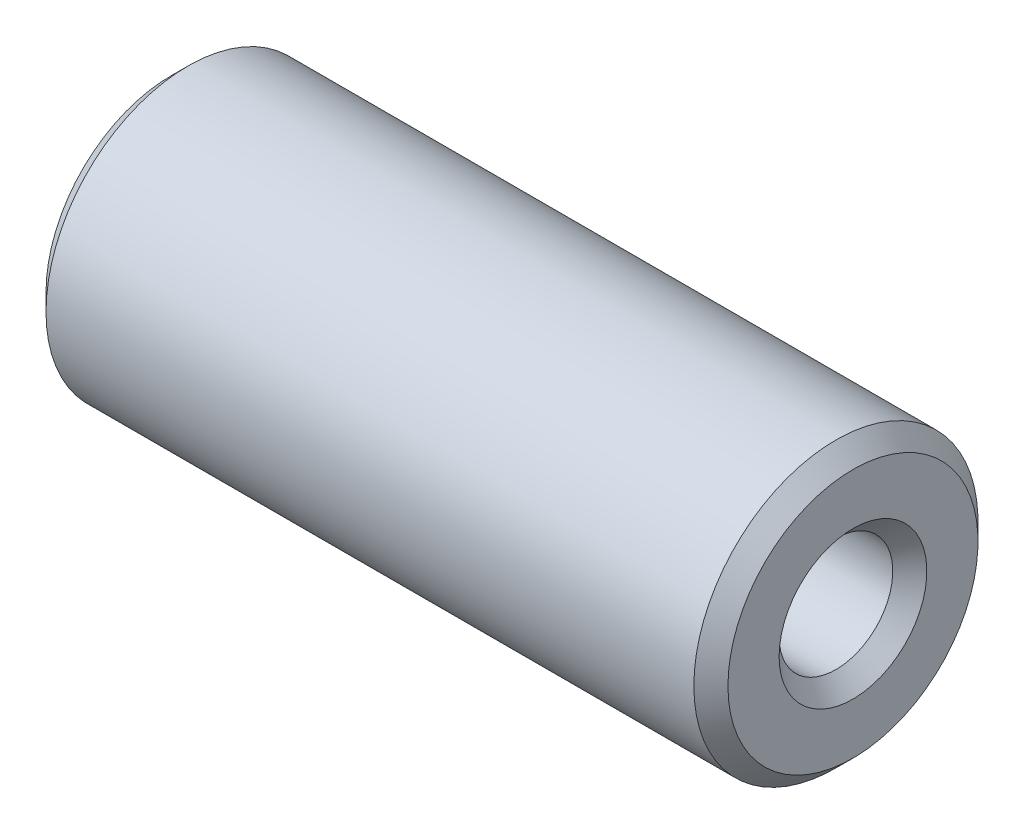
ISO-10303-21;
HEADER;
FILE_DESCRIPTION(('STEP AP214'),'2;1');
FILE_NAME('part.step','',(''),(''),'','','');
FILE_SCHEMA(('AUTOMOTIVE_DESIGN { 1 0 10303 214 1 1 1 1 }'));
ENDSEC;
DATA;
#1=APPLICATION_CONTEXT('core data for automotive mechanical design processes');
#2=APPLICATION_PROTOCOL_DEFINITION('international standard','automotive_design',2000,#1);
#3=PRODUCT_CONTEXT('',#1,'mechanical');
#4=PRODUCT('Part','Part','',(#3));
#5=PRODUCT_RELATED_PRODUCT_CATEGORY('part','',(#4));
#6=PRODUCT_DEFINITION_FORMATION('','',#4);
#7=PRODUCT_DEFINITION_CONTEXT('part definition',#1,'design');
#8=PRODUCT_DEFINITION('design','',#6,#7);
#9=PRODUCT_DEFINITION_SHAPE('','',#8);
#10=(LENGTH_UNIT() NAMED_UNIT(*) SI_UNIT(.MILLI.,.METRE.));
#11=(NAMED_UNIT(*) PLANE_ANGLE_UNIT() SI_UNIT($,.RADIAN.));
#12=(NAMED_UNIT(*) SI_UNIT($,.STERADIAN.) SOLID_ANGLE_UNIT());
#13=UNCERTAINTY_MEASURE_WITH_UNIT(LENGTH_MEASURE(1.E-05),#10,'distance_accuracy_value','');
#14=(GEOMETRIC_REPRESENTATION_CONTEXT(3) GLOBAL_UNCERTAINTY_ASSIGNED_CONTEXT((#13)) GLOBAL_UNIT_ASSIGNED_CONTEXT((#10,
#11,#12)) REPRESENTATION_CONTEXT('',''));
#15=CARTESIAN_POINT('',(0.,0.,0.));
#16=DIRECTION('',(0.,0.,1.));
#17=DIRECTION('',(1.,0.,0.));
#18=AXIS2_PLACEMENT_3D('',#15,#16,#17);
#19=CARTESIAN_POINT('',(0.,0.,0.));
#20=DIRECTION('',(-1.,0.,0.));
#21=DIRECTION('',(0.,0.,1.));
#22=AXIS2_PLACEMENT_3D('',#19,#20,#21);
#23=CONICAL_SURFACE('',#22,1.3,0.785398163397448);
#24=CARTESIAN_POINT('',(0.299999999999998,0.,0.));
#25=DIRECTION('',(-1.,0.,0.));
#26=DIRECTION('',(0.,0.,1.));
#27=AXIS2_PLACEMENT_3D('',#24,#25,#26);
#28=CIRCLE('',#27,1.);
#29=CARTESIAN_POINT('',(0.299999999999998,0.,1.));
#30=VERTEX_POINT('',#29);
#31=EDGE_CURVE('E58',#30,#30,#28,.T.);
#32=ORIENTED_EDGE('',*,*,#31,.F.);
#33=EDGE_LOOP('',(#32));
#34=FACE_BOUND('',#33,.T.);
#35=CARTESIAN_POINT('',(0.,0.,0.));
#36=DIRECTION('',(-1.,0.,0.));
#37=DIRECTION('',(0.,0.,1.));
#38=AXIS2_PLACEMENT_3D('',#35,#36,#37);
#39=CIRCLE('',#38,1.3);
#40=CARTESIAN_POINT('',(0.,0.,1.3));
#41=VERTEX_POINT('',#40);
#42=EDGE_CURVE('E10',#41,#41,#39,.T.);
#43=ORIENTED_EDGE('',*,*,#42,.T.);
#44=EDGE_LOOP('',(#43));
#45=FACE_BOUND('',#44,.T.);
#46=ADVANCED_FACE('F30',(#34,#45),#23,.F.);
#47=CARTESIAN_POINT('',(0.,1.3,0.));
#48=DIRECTION('',(1.,0.,0.));
#49=DIRECTION('',(0.,0.,-1.));
#50=AXIS2_PLACEMENT_3D('',#47,#48,#49);
#51=PLANE('',#50);
#52=ORIENTED_EDGE('',*,*,#42,.F.);
#53=EDGE_LOOP('',(#52));
#54=FACE_BOUND('',#53,.T.);
#55=CARTESIAN_POINT('',(0.,0.,0.));
#56=DIRECTION('',(-1.,0.,0.));
#57=DIRECTION('',(0.,0.,1.));
#58=AXIS2_PLACEMENT_3D('',#55,#56,#57);
#59=CIRCLE('',#58,2.2);
#60=CARTESIAN_POINT('',(0.,0.,2.2));
#61=VERTEX_POINT('',#60);
#62=EDGE_CURVE('E36',#61,#61,#59,.T.);
#63=ORIENTED_EDGE('',*,*,#62,.T.);
#64=EDGE_LOOP('',(#63));
#65=FACE_BOUND('',#64,.T.);
#66=ADVANCED_FACE('F65',(#54,#65),#51,.F.);
#67=CARTESIAN_POINT('',(0.299999999999998,0.,0.));
#68=DIRECTION('',(1.,0.,0.));
#69=DIRECTION('',(0.,0.,-1.));
#70=AXIS2_PLACEMENT_3D('',#67,#68,#69);
#71=CONICAL_SURFACE('',#70,2.5,0.785398163397447);
#72=ORIENTED_EDGE('',*,*,#62,.F.);
#73=EDGE_LOOP('',(#72));
#74=FACE_BOUND('',#73,.T.);
#75=CARTESIAN_POINT('',(0.299999999999998,0.,0.));
#76=DIRECTION('',(-1.,0.,0.));
#77=DIRECTION('',(0.,0.,1.));
#78=AXIS2_PLACEMENT_3D('',#75,#76,#77);
#79=CIRCLE('',#78,2.5);
#80=CARTESIAN_POINT('',(0.299999999999998,0.,2.5));
#81=VERTEX_POINT('',#80);
#82=EDGE_CURVE('E40',#81,#81,#79,.T.);
#83=ORIENTED_EDGE('',*,*,#82,.T.);
#84=EDGE_LOOP('',(#83));
#85=FACE_BOUND('',#84,.T.);
#86=ADVANCED_FACE('F69',(#74,#85),#71,.T.);
#87=CARTESIAN_POINT('',(0.,0.,0.));
#88=DIRECTION('',(-1.,0.,0.));
#89=DIRECTION('',(0.,0.,1.));
#90=AXIS2_PLACEMENT_3D('',#87,#88,#89);
#91=CYLINDRICAL_SURFACE('',#90,2.5);
#92=ORIENTED_EDGE('',*,*,#82,.F.);
#93=EDGE_LOOP('',(#92));
#94=FACE_BOUND('',#93,.T.);
#95=CARTESIAN_POINT('',(11.7,0.,0.));
#96=DIRECTION('',(-1.,0.,0.));
#97=DIRECTION('',(0.,0.,1.));
#98=AXIS2_PLACEMENT_3D('',#95,#96,#97);
#99=CIRCLE('',#98,2.5);
#100=CARTESIAN_POINT('',(11.7,0.,2.5));
#101=VERTEX_POINT('',#100);
#102=EDGE_CURVE('E44',#101,#101,#99,.T.);
#103=ORIENTED_EDGE('',*,*,#102,.T.);
#104=EDGE_LOOP('',(#103));
#105=FACE_BOUND('',#104,.T.);
#106=ADVANCED_FACE('F74',(#94,#105),#91,.T.);
#107=CARTESIAN_POINT('',(12.,0.,0.));
#108=DIRECTION('',(-1.,0.,0.));
#109=DIRECTION('',(0.,0.,1.));
#110=AXIS2_PLACEMENT_3D('',#107,#108,#109);
#111=CONICAL_SURFACE('',#110,2.2,0.78539816339745);
#112=ORIENTED_EDGE('',*,*,#102,.F.);
#113=EDGE_LOOP('',(#112));
#114=FACE_BOUND('',#113,.T.);
#115=CARTESIAN_POINT('',(12.,0.,0.));
#116=DIRECTION('',(-1.,0.,0.));
#117=DIRECTION('',(0.,0.,1.));
#118=AXIS2_PLACEMENT_3D('',#115,#116,#117);
#119=CIRCLE('',#118,2.2);
#120=CARTESIAN_POINT('',(12.,0.,2.2));
#121=VERTEX_POINT('',#120);
#122=EDGE_CURVE('E49',#121,#121,#119,.T.);
#123=ORIENTED_EDGE('',*,*,#122,.T.);
#124=EDGE_LOOP('',(#123));
#125=FACE_BOUND('',#124,.T.);
#126=ADVANCED_FACE('F80',(#114,#125),#111,.T.);
#127=CARTESIAN_POINT('',(12.,2.19999999999998,0.));
#128=DIRECTION('',(-1.,0.,0.));
#129=DIRECTION('',(0.,0.,1.));
#130=AXIS2_PLACEMENT_3D('',#127,#128,#129);
#131=PLANE('',#130);
#132=ORIENTED_EDGE('',*,*,#122,.F.);
#133=EDGE_LOOP('',(#132));
#134=FACE_BOUND('',#133,.T.);
#135=CARTESIAN_POINT('',(12.,0.,0.));
#136=DIRECTION('',(-1.,0.,0.));
#137=DIRECTION('',(0.,0.,1.));
#138=AXIS2_PLACEMENT_3D('',#135,#136,#137);
#139=CIRCLE('',#138,1.3);
#140=CARTESIAN_POINT('',(12.,0.,1.3));
#141=VERTEX_POINT('',#140);
#142=EDGE_CURVE('E52',#141,#141,#139,.T.);
#143=ORIENTED_EDGE('',*,*,#142,.T.);
#144=EDGE_LOOP('',(#143));
#145=FACE_BOUND('',#144,.T.);
#146=ADVANCED_FACE('F84',(#134,#145),#131,.F.);
#147=CARTESIAN_POINT('',(11.7,0.,0.));
#148=DIRECTION('',(1.,0.,0.));
#149=DIRECTION('',(0.,0.,-1.));
#150=AXIS2_PLACEMENT_3D('',#147,#148,#149);
#151=CONICAL_SURFACE('',#150,1.,0.785398163397443);
#152=ORIENTED_EDGE('',*,*,#142,.F.);
#153=EDGE_LOOP('',(#152));
#154=FACE_BOUND('',#153,.T.);
#155=CARTESIAN_POINT('',(11.7,0.,0.));
#156=DIRECTION('',(-1.,0.,0.));
#157=DIRECTION('',(0.,0.,1.));
#158=AXIS2_PLACEMENT_3D('',#155,#156,#157);
#159=CIRCLE('',#158,1.);
#160=CARTESIAN_POINT('',(11.7,0.,1.));
#161=VERTEX_POINT('',#160);
#162=EDGE_CURVE('E55',#161,#161,#159,.T.);
#163=ORIENTED_EDGE('',*,*,#162,.T.);
#164=EDGE_LOOP('',(#163));
#165=FACE_BOUND('',#164,.T.);
#166=ADVANCED_FACE('F88',(#154,#165),#151,.F.);
#167=CARTESIAN_POINT('',(0.,0.,0.));
#168=DIRECTION('',(-1.,0.,0.));
#169=DIRECTION('',(0.,0.,1.));
#170=AXIS2_PLACEMENT_3D('',#167,#168,#169);
#171=CYLINDRICAL_SURFACE('',#170,1.);
#172=ORIENTED_EDGE('',*,*,#162,.F.);
#173=EDGE_LOOP('',(#172));
#174=FACE_BOUND('',#173,.T.);
#175=ORIENTED_EDGE('',*,*,#31,.T.);
#176=EDGE_LOOP('',(#175));
#177=FACE_BOUND('',#176,.T.);
#178=ADVANCED_FACE('F62',(#174,#177),#171,.F.);
#179=CLOSED_SHELL('',(#46,#66,#86,#106,#126,#146,#166,#178));
#180=MANIFOLD_SOLID_BREP('B2',#179);
#181=ADVANCED_BREP_SHAPE_REPRESENTATION('',(#18,#180),#14);
#182=SHAPE_DEFINITION_REPRESENTATION(#9,#181);
ENDSEC;
END-ISO-10303-21;
